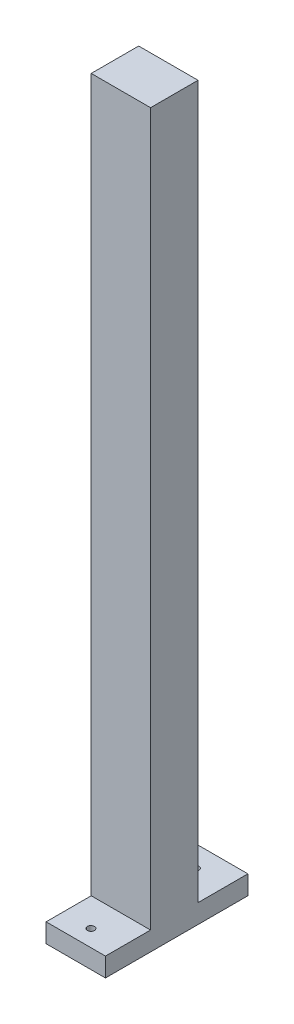
ISO-10303-21;
HEADER;
FILE_DESCRIPTION(('STEP AP214'),'2;1');
FILE_NAME('part.step','',(''),(''),'','','');
FILE_SCHEMA(('AUTOMOTIVE_DESIGN { 1 0 10303 214 1 1 1 1 }'));
ENDSEC;
DATA;
#1=APPLICATION_CONTEXT('core data for automotive mechanical design processes');
#2=APPLICATION_PROTOCOL_DEFINITION('international standard','automotive_design',2000,#1);
#3=PRODUCT_CONTEXT('',#1,'mechanical');
#4=PRODUCT('Part','Part','',(#3));
#5=PRODUCT_RELATED_PRODUCT_CATEGORY('part','',(#4));
#6=PRODUCT_DEFINITION_FORMATION('','',#4);
#7=PRODUCT_DEFINITION_CONTEXT('part definition',#1,'design');
#8=PRODUCT_DEFINITION('design','',#6,#7);
#9=PRODUCT_DEFINITION_SHAPE('','',#8);
#10=(LENGTH_UNIT() NAMED_UNIT(*) SI_UNIT(.MILLI.,.METRE.));
#11=(NAMED_UNIT(*) PLANE_ANGLE_UNIT() SI_UNIT($,.RADIAN.));
#12=(NAMED_UNIT(*) SI_UNIT($,.STERADIAN.) SOLID_ANGLE_UNIT());
#13=UNCERTAINTY_MEASURE_WITH_UNIT(LENGTH_MEASURE(1.E-05),#10,'distance_accuracy_value','');
#14=(GEOMETRIC_REPRESENTATION_CONTEXT(3) GLOBAL_UNCERTAINTY_ASSIGNED_CONTEXT((#13)) GLOBAL_UNIT_ASSIGNED_CONTEXT((#10,
#11,#12)) REPRESENTATION_CONTEXT('',''));
#15=CARTESIAN_POINT('',(0.,0.,0.));
#16=DIRECTION('',(0.,0.,1.));
#17=DIRECTION('',(1.,0.,0.));
#18=AXIS2_PLACEMENT_3D('',#15,#16,#17);
#19=CARTESIAN_POINT('',(-10.,8.,29.));
#20=DIRECTION('',(0.,0.,1.));
#21=DIRECTION('',(1.,0.,0.));
#22=AXIS2_PLACEMENT_3D('',#19,#20,#21);
#23=PLANE('',#22);
#24=DIRECTION('',(1.,0.,0.));
#25=VECTOR('',#24,1.);
#26=CARTESIAN_POINT('',(-10.,0.,29.));
#27=LINE('',#26,#25);
#28=CARTESIAN_POINT('',(-10.,0.,29.));
#29=VERTEX_POINT('',#28);
#30=CARTESIAN_POINT('',(15.,0.,29.));
#31=VERTEX_POINT('',#30);
#32=EDGE_CURVE('E36',#29,#31,#27,.T.);
#33=ORIENTED_EDGE('',*,*,#32,.T.);
#34=DIRECTION('',(0.,-1.,0.));
#35=VECTOR('',#34,1.);
#36=CARTESIAN_POINT('',(15.,8.,29.));
#37=LINE('',#36,#35);
#38=CARTESIAN_POINT('',(15.,8.,29.));
#39=VERTEX_POINT('',#38);
#40=EDGE_CURVE('E97',#39,#31,#37,.T.);
#41=ORIENTED_EDGE('',*,*,#40,.F.);
#42=DIRECTION('',(1.,0.,0.));
#43=VECTOR('',#42,1.);
#44=CARTESIAN_POINT('',(-10.,8.,29.));
#45=LINE('',#44,#43);
#46=CARTESIAN_POINT('',(-10.,8.,29.));
#47=VERTEX_POINT('',#46);
#48=EDGE_CURVE('E11',#47,#39,#45,.T.);
#49=ORIENTED_EDGE('',*,*,#48,.F.);
#50=DIRECTION('',(0.,-1.,0.));
#51=VECTOR('',#50,1.);
#52=CARTESIAN_POINT('',(-10.,8.,29.));
#53=LINE('',#52,#51);
#54=EDGE_CURVE('E98',#47,#29,#53,.T.);
#55=ORIENTED_EDGE('',*,*,#54,.T.);
#56=EDGE_LOOP('',(#33,#41,#49,#55));
#57=FACE_BOUND('',#56,.T.);
#58=ADVANCED_FACE('F33',(#57),#23,.T.);
#59=CARTESIAN_POINT('',(-10.,8.,29.));
#60=DIRECTION('',(0.,1.,0.));
#61=DIRECTION('',(0.,0.,1.));
#62=AXIS2_PLACEMENT_3D('',#59,#60,#61);
#63=PLANE('',#62);
#64=CARTESIAN_POINT('',(1.86332008263435,8.,22.));
#65=DIRECTION('',(0.,1.,0.));
#66=DIRECTION('',(0.,0.,1.));
#67=AXIS2_PLACEMENT_3D('',#64,#65,#66);
#68=CIRCLE('',#67,1.5);
#69=CARTESIAN_POINT('',(1.86332008263435,8.,23.5));
#70=VERTEX_POINT('',#69);
#71=EDGE_CURVE('E119',#70,#70,#68,.T.);
#72=ORIENTED_EDGE('',*,*,#71,.F.);
#73=EDGE_LOOP('',(#72));
#74=FACE_BOUND('',#73,.T.);
#75=ORIENTED_EDGE('',*,*,#48,.T.);
#76=DIRECTION('',(0.,0.,1.));
#77=VECTOR('',#76,1.);
#78=CARTESIAN_POINT('',(15.,8.,29.));
#79=LINE('',#78,#77);
#80=CARTESIAN_POINT('',(15.,8.,10.));
#81=VERTEX_POINT('',#80);
#82=EDGE_CURVE('E115',#81,#39,#79,.T.);
#83=ORIENTED_EDGE('',*,*,#82,.F.);
#84=DIRECTION('',(1.,0.,0.));
#85=VECTOR('',#84,1.);
#86=CARTESIAN_POINT('',(-10.,8.,10.));
#87=LINE('',#86,#85);
#88=CARTESIAN_POINT('',(-10.,8.,10.));
#89=VERTEX_POINT('',#88);
#90=EDGE_CURVE('E41',#89,#81,#87,.T.);
#91=ORIENTED_EDGE('',*,*,#90,.F.);
#92=DIRECTION('',(0.,0.,1.));
#93=VECTOR('',#92,1.);
#94=CARTESIAN_POINT('',(-10.,8.,29.));
#95=LINE('',#94,#93);
#96=EDGE_CURVE('E103',#89,#47,#95,.T.);
#97=ORIENTED_EDGE('',*,*,#96,.T.);
#98=EDGE_LOOP('',(#75,#83,#91,#97));
#99=FACE_BOUND('',#98,.T.);
#100=ADVANCED_FACE('F184',(#74,#99),#63,.T.);
#101=CARTESIAN_POINT('',(-10.,8.,10.));
#102=DIRECTION('',(0.,0.,1.));
#103=DIRECTION('',(1.,0.,0.));
#104=AXIS2_PLACEMENT_3D('',#101,#102,#103);
#105=PLANE('',#104);
#106=ORIENTED_EDGE('',*,*,#90,.T.);
#107=DIRECTION('',(0.,-1.,0.));
#108=VECTOR('',#107,1.);
#109=CARTESIAN_POINT('',(15.,8.,10.));
#110=LINE('',#109,#108);
#111=CARTESIAN_POINT('',(15.,308.,10.));
#112=VERTEX_POINT('',#111);
#113=EDGE_CURVE('E133',#112,#81,#110,.T.);
#114=ORIENTED_EDGE('',*,*,#113,.F.);
#115=DIRECTION('',(1.,0.,0.));
#116=VECTOR('',#115,1.);
#117=CARTESIAN_POINT('',(-10.,308.,10.));
#118=LINE('',#117,#116);
#119=CARTESIAN_POINT('',(-10.,308.,10.));
#120=VERTEX_POINT('',#119);
#121=EDGE_CURVE('E155',#120,#112,#118,.T.);
#122=ORIENTED_EDGE('',*,*,#121,.F.);
#123=DIRECTION('',(0.,-1.,0.));
#124=VECTOR('',#123,1.);
#125=CARTESIAN_POINT('',(-10.,8.,10.));
#126=LINE('',#125,#124);
#127=EDGE_CURVE('E151',#120,#89,#126,.T.);
#128=ORIENTED_EDGE('',*,*,#127,.T.);
#129=EDGE_LOOP('',(#106,#114,#122,#128));
#130=FACE_BOUND('',#129,.T.);
#131=ADVANCED_FACE('F183',(#130),#105,.T.);
#132=CARTESIAN_POINT('',(-10.,308.,10.));
#133=DIRECTION('',(0.,1.,0.));
#134=DIRECTION('',(0.,0.,1.));
#135=AXIS2_PLACEMENT_3D('',#132,#133,#134);
#136=PLANE('',#135);
#137=ORIENTED_EDGE('',*,*,#121,.T.);
#138=DIRECTION('',(0.,0.,1.));
#139=VECTOR('',#138,1.);
#140=CARTESIAN_POINT('',(15.,308.,10.));
#141=LINE('',#140,#139);
#142=CARTESIAN_POINT('',(15.,308.,-9.99999999999997));
#143=VERTEX_POINT('',#142);
#144=EDGE_CURVE('E130',#143,#112,#141,.T.);
#145=ORIENTED_EDGE('',*,*,#144,.F.);
#146=DIRECTION('',(1.,0.,0.));
#147=VECTOR('',#146,1.);
#148=CARTESIAN_POINT('',(-10.,308.,-9.99999999999997));
#149=LINE('',#148,#147);
#150=CARTESIAN_POINT('',(-10.,308.,-9.99999999999997));
#151=VERTEX_POINT('',#150);
#152=EDGE_CURVE('E157',#151,#143,#149,.T.);
#153=ORIENTED_EDGE('',*,*,#152,.F.);
#154=DIRECTION('',(0.,0.,1.));
#155=VECTOR('',#154,1.);
#156=CARTESIAN_POINT('',(-10.,308.,10.));
#157=LINE('',#156,#155);
#158=EDGE_CURVE('E148',#151,#120,#157,.T.);
#159=ORIENTED_EDGE('',*,*,#158,.T.);
#160=EDGE_LOOP('',(#137,#145,#153,#159));
#161=FACE_BOUND('',#160,.T.);
#162=ADVANCED_FACE('F179',(#161),#136,.T.);
#163=CARTESIAN_POINT('',(-10.,308.,-9.99999999999997));
#164=DIRECTION('',(0.,0.,-1.));
#165=DIRECTION('',(0.,1.,0.));
#166=AXIS2_PLACEMENT_3D('',#163,#164,#165);
#167=PLANE('',#166);
#168=ORIENTED_EDGE('',*,*,#152,.T.);
#169=DIRECTION('',(0.,1.,0.));
#170=VECTOR('',#169,1.);
#171=CARTESIAN_POINT('',(15.,308.,-9.99999999999997));
#172=LINE('',#171,#170);
#173=CARTESIAN_POINT('',(15.,8.,-10.));
#174=VERTEX_POINT('',#173);
#175=EDGE_CURVE('E127',#174,#143,#172,.T.);
#176=ORIENTED_EDGE('',*,*,#175,.F.);
#177=DIRECTION('',(1.,0.,0.));
#178=VECTOR('',#177,1.);
#179=CARTESIAN_POINT('',(-10.,8.,-10.));
#180=LINE('',#179,#178);
#181=CARTESIAN_POINT('',(-10.,8.,-10.));
#182=VERTEX_POINT('',#181);
#183=EDGE_CURVE('E159',#182,#174,#180,.T.);
#184=ORIENTED_EDGE('',*,*,#183,.F.);
#185=DIRECTION('',(0.,1.,0.));
#186=VECTOR('',#185,1.);
#187=CARTESIAN_POINT('',(-10.,308.,-9.99999999999997));
#188=LINE('',#187,#186);
#189=EDGE_CURVE('E145',#182,#151,#188,.T.);
#190=ORIENTED_EDGE('',*,*,#189,.T.);
#191=EDGE_LOOP('',(#168,#176,#184,#190));
#192=FACE_BOUND('',#191,.T.);
#193=ADVANCED_FACE('F172',(#192),#167,.T.);
#194=CARTESIAN_POINT('',(-10.,8.,-10.));
#195=DIRECTION('',(0.,1.,0.));
#196=DIRECTION('',(0.,0.,1.));
#197=AXIS2_PLACEMENT_3D('',#194,#195,#196);
#198=PLANE('',#197);
#199=CARTESIAN_POINT('',(1.86332008263435,8.,-22.));
#200=DIRECTION('',(0.,-1.,0.));
#201=DIRECTION('',(0.,0.,-1.));
#202=AXIS2_PLACEMENT_3D('',#199,#200,#201);
#203=CIRCLE('',#202,1.5);
#204=CARTESIAN_POINT('',(1.86332008263435,8.,-23.5));
#205=VERTEX_POINT('',#204);
#206=EDGE_CURVE('E222',#205,#205,#203,.T.);
#207=ORIENTED_EDGE('',*,*,#206,.T.);
#208=EDGE_LOOP('',(#207));
#209=FACE_BOUND('',#208,.T.);
#210=ORIENTED_EDGE('',*,*,#183,.T.);
#211=DIRECTION('',(0.,0.,1.));
#212=VECTOR('',#211,1.);
#213=CARTESIAN_POINT('',(15.,8.,-10.));
#214=LINE('',#213,#212);
#215=CARTESIAN_POINT('',(15.,8.,-31.));
#216=VERTEX_POINT('',#215);
#217=EDGE_CURVE('E124',#216,#174,#214,.T.);
#218=ORIENTED_EDGE('',*,*,#217,.F.);
#219=DIRECTION('',(1.,0.,0.));
#220=VECTOR('',#219,1.);
#221=CARTESIAN_POINT('',(-10.,8.,-31.));
#222=LINE('',#221,#220);
#223=CARTESIAN_POINT('',(-10.,8.,-31.));
#224=VERTEX_POINT('',#223);
#225=EDGE_CURVE('E161',#224,#216,#222,.T.);
#226=ORIENTED_EDGE('',*,*,#225,.F.);
#227=DIRECTION('',(0.,0.,1.));
#228=VECTOR('',#227,1.);
#229=CARTESIAN_POINT('',(-10.,8.,-10.));
#230=LINE('',#229,#228);
#231=EDGE_CURVE('E142',#224,#182,#230,.T.);
#232=ORIENTED_EDGE('',*,*,#231,.T.);
#233=EDGE_LOOP('',(#210,#218,#226,#232));
#234=FACE_BOUND('',#233,.T.);
#235=ADVANCED_FACE('F169',(#209,#234),#198,.T.);
#236=CARTESIAN_POINT('',(-10.,8.,-31.));
#237=DIRECTION('',(0.,0.,-1.));
#238=DIRECTION('',(0.,1.,0.));
#239=AXIS2_PLACEMENT_3D('',#236,#237,#238);
#240=PLANE('',#239);
#241=ORIENTED_EDGE('',*,*,#225,.T.);
#242=DIRECTION('',(0.,1.,0.));
#243=VECTOR('',#242,1.);
#244=CARTESIAN_POINT('',(15.,8.,-31.));
#245=LINE('',#244,#243);
#246=CARTESIAN_POINT('',(15.,0.,-31.));
#247=VERTEX_POINT('',#246);
#248=EDGE_CURVE('E110',#247,#216,#245,.T.);
#249=ORIENTED_EDGE('',*,*,#248,.F.);
#250=DIRECTION('',(1.,0.,0.));
#251=VECTOR('',#250,1.);
#252=CARTESIAN_POINT('',(-10.,0.,-31.));
#253=LINE('',#252,#251);
#254=CARTESIAN_POINT('',(-10.,0.,-31.));
#255=VERTEX_POINT('',#254);
#256=EDGE_CURVE('E102',#255,#247,#253,.T.);
#257=ORIENTED_EDGE('',*,*,#256,.F.);
#258=DIRECTION('',(0.,1.,0.));
#259=VECTOR('',#258,1.);
#260=CARTESIAN_POINT('',(-10.,8.,-31.));
#261=LINE('',#260,#259);
#262=EDGE_CURVE('E139',#255,#224,#261,.T.);
#263=ORIENTED_EDGE('',*,*,#262,.T.);
#264=EDGE_LOOP('',(#241,#249,#257,#263));
#265=FACE_BOUND('',#264,.T.);
#266=ADVANCED_FACE('F163',(#265),#240,.T.);
#267=CARTESIAN_POINT('',(-10.,0.,29.));
#268=DIRECTION('',(0.,-1.,0.));
#269=DIRECTION('',(0.,0.,-1.));
#270=AXIS2_PLACEMENT_3D('',#267,#268,#269);
#271=PLANE('',#270);
#272=CARTESIAN_POINT('',(1.86332008263435,0.,-22.));
#273=DIRECTION('',(0.,-1.,0.));
#274=DIRECTION('',(0.,0.,-1.));
#275=AXIS2_PLACEMENT_3D('',#272,#273,#274);
#276=CIRCLE('',#275,1.5);
#277=CARTESIAN_POINT('',(1.86332008263435,0.,-23.5));
#278=VERTEX_POINT('',#277);
#279=EDGE_CURVE('E213',#278,#278,#276,.T.);
#280=ORIENTED_EDGE('',*,*,#279,.F.);
#281=EDGE_LOOP('',(#280));
#282=FACE_BOUND('',#281,.T.);
#283=CARTESIAN_POINT('',(1.86332008263435,0.,22.));
#284=DIRECTION('',(0.,1.,0.));
#285=DIRECTION('',(0.,0.,1.));
#286=AXIS2_PLACEMENT_3D('',#283,#284,#285);
#287=CIRCLE('',#286,1.5);
#288=CARTESIAN_POINT('',(1.86332008263435,0.,23.5));
#289=VERTEX_POINT('',#288);
#290=EDGE_CURVE('E116',#289,#289,#287,.T.);
#291=ORIENTED_EDGE('',*,*,#290,.T.);
#292=EDGE_LOOP('',(#291));
#293=FACE_BOUND('',#292,.T.);
#294=ORIENTED_EDGE('',*,*,#256,.T.);
#295=DIRECTION('',(0.,0.,-1.));
#296=VECTOR('',#295,1.);
#297=CARTESIAN_POINT('',(15.,0.,29.));
#298=LINE('',#297,#296);
#299=EDGE_CURVE('E105',#31,#247,#298,.T.);
#300=ORIENTED_EDGE('',*,*,#299,.F.);
#301=ORIENTED_EDGE('',*,*,#32,.F.);
#302=DIRECTION('',(0.,0.,-1.));
#303=VECTOR('',#302,1.);
#304=CARTESIAN_POINT('',(-10.,0.,29.));
#305=LINE('',#304,#303);
#306=EDGE_CURVE('E137',#29,#255,#305,.T.);
#307=ORIENTED_EDGE('',*,*,#306,.T.);
#308=EDGE_LOOP('',(#294,#300,#301,#307));
#309=FACE_BOUND('',#308,.T.);
#310=ADVANCED_FACE('F106',(#282,#293,#309),#271,.T.);
#311=CARTESIAN_POINT('',(-10.,0.,0.));
#312=DIRECTION('',(1.,0.,0.));
#313=DIRECTION('',(0.,0.,-1.));
#314=AXIS2_PLACEMENT_3D('',#311,#312,#313);
#315=PLANE('',#314);
#316=ORIENTED_EDGE('',*,*,#54,.F.);
#317=ORIENTED_EDGE('',*,*,#96,.F.);
#318=ORIENTED_EDGE('',*,*,#127,.F.);
#319=ORIENTED_EDGE('',*,*,#158,.F.);
#320=ORIENTED_EDGE('',*,*,#189,.F.);
#321=ORIENTED_EDGE('',*,*,#231,.F.);
#322=ORIENTED_EDGE('',*,*,#262,.F.);
#323=ORIENTED_EDGE('',*,*,#306,.F.);
#324=EDGE_LOOP('',(#316,#317,#318,#319,#320,#321,#322,#323));
#325=FACE_BOUND('',#324,.T.);
#326=ADVANCED_FACE('F175',(#325),#315,.F.);
#327=CARTESIAN_POINT('',(15.,0.,0.));
#328=DIRECTION('',(1.,0.,0.));
#329=DIRECTION('',(0.,0.,-1.));
#330=AXIS2_PLACEMENT_3D('',#327,#328,#329);
#331=PLANE('',#330);
#332=ORIENTED_EDGE('',*,*,#40,.T.);
#333=ORIENTED_EDGE('',*,*,#299,.T.);
#334=ORIENTED_EDGE('',*,*,#248,.T.);
#335=ORIENTED_EDGE('',*,*,#217,.T.);
#336=ORIENTED_EDGE('',*,*,#175,.T.);
#337=ORIENTED_EDGE('',*,*,#144,.T.);
#338=ORIENTED_EDGE('',*,*,#113,.T.);
#339=ORIENTED_EDGE('',*,*,#82,.T.);
#340=EDGE_LOOP('',(#332,#333,#334,#335,#336,#337,#338,#339));
#341=FACE_BOUND('',#340,.T.);
#342=ADVANCED_FACE('F113',(#341),#331,.T.);
#343=CARTESIAN_POINT('',(1.86332008263435,0.,22.));
#344=DIRECTION('',(0.,1.,0.));
#345=DIRECTION('',(0.,0.,1.));
#346=AXIS2_PLACEMENT_3D('',#343,#344,#345);
#347=CYLINDRICAL_SURFACE('',#346,1.5);
#348=ORIENTED_EDGE('',*,*,#290,.F.);
#349=EDGE_LOOP('',(#348));
#350=FACE_BOUND('',#349,.T.);
#351=ORIENTED_EDGE('',*,*,#71,.T.);
#352=EDGE_LOOP('',(#351));
#353=FACE_BOUND('',#352,.T.);
#354=ADVANCED_FACE('F216',(#350,#353),#347,.F.);
#355=CARTESIAN_POINT('',(1.86332008263435,0.,-22.));
#356=DIRECTION('',(0.,1.,0.));
#357=DIRECTION('',(0.,0.,1.));
#358=AXIS2_PLACEMENT_3D('',#355,#356,#357);
#359=CYLINDRICAL_SURFACE('',#358,1.5);
#360=ORIENTED_EDGE('',*,*,#279,.T.);
#361=EDGE_LOOP('',(#360));
#362=FACE_BOUND('',#361,.T.);
#363=ORIENTED_EDGE('',*,*,#206,.F.);
#364=EDGE_LOOP('',(#363));
#365=FACE_BOUND('',#364,.T.);
#366=ADVANCED_FACE('F219',(#362,#365),#359,.F.);
#367=CLOSED_SHELL('',(#58,#100,#131,#162,#193,#235,#266,#310,#326,#342,#354,#366));
#368=MANIFOLD_SOLID_BREP('B2',#367);
#369=ADVANCED_BREP_SHAPE_REPRESENTATION('',(#18,#368),#14);
#370=SHAPE_DEFINITION_REPRESENTATION(#9,#369);
ENDSEC;
END-ISO-10303-21;
